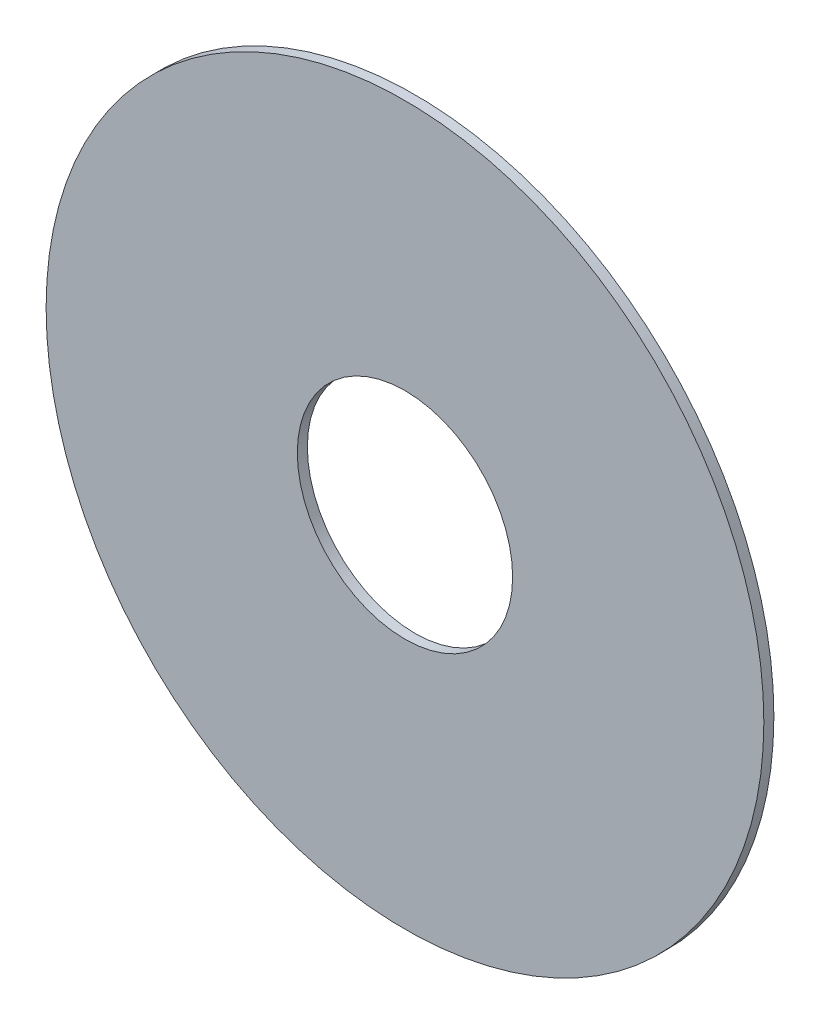
ISO-10303-21;
HEADER;
FILE_DESCRIPTION(('STEP AP214'),'2;1');
FILE_NAME('part.step','',(''),(''),'','','');
FILE_SCHEMA(('AUTOMOTIVE_DESIGN { 1 0 10303 214 1 1 1 1 }'));
ENDSEC;
DATA;
#1=APPLICATION_CONTEXT('core data for automotive mechanical design processes');
#2=APPLICATION_PROTOCOL_DEFINITION('international standard','automotive_design',2000,#1);
#3=PRODUCT_CONTEXT('',#1,'mechanical');
#4=PRODUCT('Part','Part','',(#3));
#5=PRODUCT_RELATED_PRODUCT_CATEGORY('part','',(#4));
#6=PRODUCT_DEFINITION_FORMATION('','',#4);
#7=PRODUCT_DEFINITION_CONTEXT('part definition',#1,'design');
#8=PRODUCT_DEFINITION('design','',#6,#7);
#9=PRODUCT_DEFINITION_SHAPE('','',#8);
#10=(LENGTH_UNIT() NAMED_UNIT(*) SI_UNIT(.MILLI.,.METRE.));
#11=(NAMED_UNIT(*) PLANE_ANGLE_UNIT() SI_UNIT($,.RADIAN.));
#12=(NAMED_UNIT(*) SI_UNIT($,.STERADIAN.) SOLID_ANGLE_UNIT());
#13=UNCERTAINTY_MEASURE_WITH_UNIT(LENGTH_MEASURE(1.E-05),#10,'distance_accuracy_value','');
#14=(GEOMETRIC_REPRESENTATION_CONTEXT(3) GLOBAL_UNCERTAINTY_ASSIGNED_CONTEXT((#13)) GLOBAL_UNIT_ASSIGNED_CONTEXT((#10,
#11,#12)) REPRESENTATION_CONTEXT('',''));
#15=CARTESIAN_POINT('',(0.,0.,0.));
#16=DIRECTION('',(0.,0.,1.));
#17=DIRECTION('',(1.,0.,0.));
#18=AXIS2_PLACEMENT_3D('',#15,#16,#17);
#19=CARTESIAN_POINT('',(176.276,-95.504,-0.045));
#20=DIRECTION('',(0.,0.,-1.));
#21=DIRECTION('',(0.,-1.,0.));
#22=AXIS2_PLACEMENT_3D('',#19,#20,#21);
#23=CYLINDRICAL_SURFACE('',#22,0.375);
#24=CARTESIAN_POINT('',(176.276,-95.504,1.67));
#25=DIRECTION('',(0.,0.,-1.));
#26=DIRECTION('',(0.,-1.,0.));
#27=AXIS2_PLACEMENT_3D('',#24,#25,#26);
#28=CIRCLE('',#27,0.375);
#29=CARTESIAN_POINT('',(176.276,-95.879,1.67));
#30=VERTEX_POINT('',#29);
#31=EDGE_CURVE('E25',#30,#30,#28,.T.);
#32=ORIENTED_EDGE('',*,*,#31,.T.);
#33=DIRECTION('',(0.,0.,1.));
#34=VECTOR('',#33,1.);
#35=CARTESIAN_POINT('',(176.276,-95.879,-0.045));
#36=LINE('',#35,#34);
#37=CARTESIAN_POINT('',(176.276,-95.879,1.705));
#38=VERTEX_POINT('',#37);
#39=EDGE_CURVE('E11',#30,#38,#36,.T.);
#40=ORIENTED_EDGE('',*,*,#39,.T.);
#41=CARTESIAN_POINT('',(176.276,-95.504,1.705));
#42=DIRECTION('',(0.,0.,-1.));
#43=DIRECTION('',(0.,-1.,0.));
#44=AXIS2_PLACEMENT_3D('',#41,#42,#43);
#45=CIRCLE('',#44,0.375);
#46=EDGE_CURVE('E69',#38,#38,#45,.T.);
#47=ORIENTED_EDGE('',*,*,#46,.F.);
#48=ORIENTED_EDGE('',*,*,#39,.F.);
#49=EDGE_LOOP('',(#32,#40,#47,#48));
#50=FACE_BOUND('',#49,.T.);
#51=ADVANCED_FACE('F17',(#50),#23,.F.);
#52=CARTESIAN_POINT('',(176.276,-95.504,1.67));
#53=DIRECTION('',(0.,0.,1.));
#54=DIRECTION('',(1.,0.,0.));
#55=AXIS2_PLACEMENT_3D('',#52,#53,#54);
#56=PLANE('',#55);
#57=ORIENTED_EDGE('',*,*,#31,.F.);
#58=EDGE_LOOP('',(#57));
#59=FACE_BOUND('',#58,.T.);
#60=CARTESIAN_POINT('',(176.276,-95.504,1.67));
#61=DIRECTION('',(0.,0.,1.));
#62=DIRECTION('',(1.,0.,0.));
#63=AXIS2_PLACEMENT_3D('',#60,#61,#62);
#64=CIRCLE('',#63,1.25);
#65=CARTESIAN_POINT('',(177.526,-95.504,1.67));
#66=VERTEX_POINT('',#65);
#67=EDGE_CURVE('E56',#66,#66,#64,.T.);
#68=ORIENTED_EDGE('',*,*,#67,.F.);
#69=EDGE_LOOP('',(#68));
#70=FACE_BOUND('',#69,.T.);
#71=ADVANCED_FACE('F76',(#59,#70),#56,.F.);
#72=CARTESIAN_POINT('',(176.276,-95.504,1.705));
#73=DIRECTION('',(0.,0.,1.));
#74=DIRECTION('',(1.,0.,0.));
#75=AXIS2_PLACEMENT_3D('',#72,#73,#74);
#76=PLANE('',#75);
#77=ORIENTED_EDGE('',*,*,#46,.T.);
#78=EDGE_LOOP('',(#77));
#79=FACE_BOUND('',#78,.T.);
#80=CARTESIAN_POINT('',(176.276,-95.504,1.705));
#81=DIRECTION('',(0.,0.,1.));
#82=DIRECTION('',(1.,0.,0.));
#83=AXIS2_PLACEMENT_3D('',#80,#81,#82);
#84=CIRCLE('',#83,1.25);
#85=CARTESIAN_POINT('',(177.526,-95.504,1.705));
#86=VERTEX_POINT('',#85);
#87=EDGE_CURVE('E54',#86,#86,#84,.T.);
#88=ORIENTED_EDGE('',*,*,#87,.T.);
#89=EDGE_LOOP('',(#88));
#90=FACE_BOUND('',#89,.T.);
#91=ADVANCED_FACE('F60',(#79,#90),#76,.T.);
#92=CARTESIAN_POINT('',(176.276,-95.504,1.67));
#93=DIRECTION('',(0.,0.,1.));
#94=DIRECTION('',(1.,0.,0.));
#95=AXIS2_PLACEMENT_3D('',#92,#93,#94);
#96=CYLINDRICAL_SURFACE('',#95,1.25);
#97=ORIENTED_EDGE('',*,*,#87,.F.);
#98=DIRECTION('',(0.,0.,1.));
#99=VECTOR('',#98,1.);
#100=CARTESIAN_POINT('',(177.526,-95.504,1.67));
#101=LINE('',#100,#99);
#102=EDGE_CURVE('E51',#66,#86,#101,.T.);
#103=ORIENTED_EDGE('',*,*,#102,.F.);
#104=ORIENTED_EDGE('',*,*,#67,.T.);
#105=ORIENTED_EDGE('',*,*,#102,.T.);
#106=EDGE_LOOP('',(#97,#103,#104,#105));
#107=FACE_BOUND('',#106,.T.);
#108=ADVANCED_FACE('F53',(#107),#96,.T.);
#109=CLOSED_SHELL('',(#51,#71,#91,#108));
#110=MANIFOLD_SOLID_BREP('B1',#109);
#111=ADVANCED_BREP_SHAPE_REPRESENTATION('',(#18,#110),#14);
#112=SHAPE_DEFINITION_REPRESENTATION(#9,#111);
ENDSEC;
END-ISO-10303-21;
